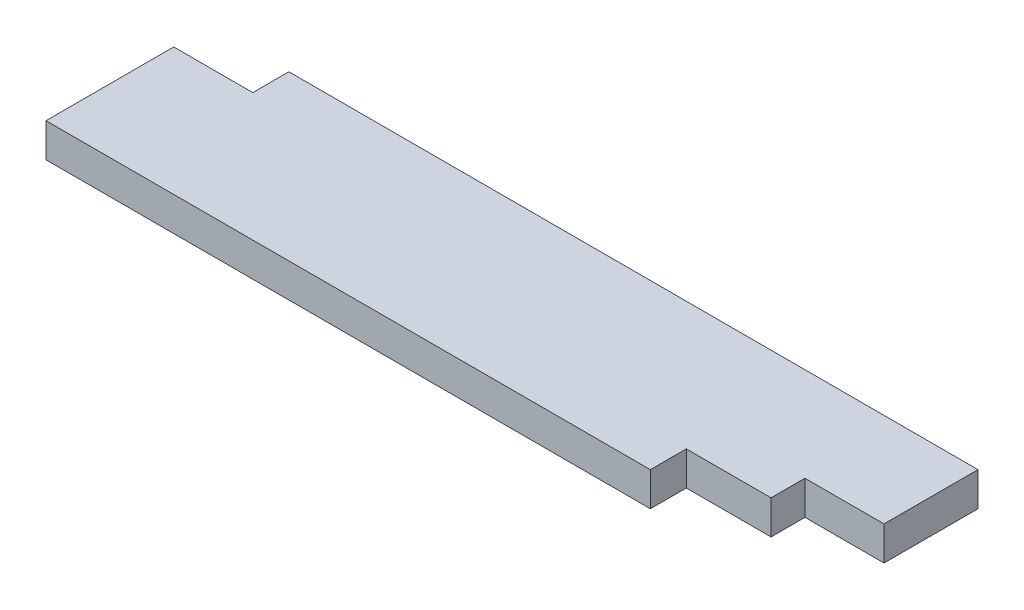
ISO-10303-21;
HEADER;
FILE_DESCRIPTION(('STEP AP214'),'2;1');
FILE_NAME('part.step','',(''),(''),'','','');
FILE_SCHEMA(('AUTOMOTIVE_DESIGN { 1 0 10303 214 1 1 1 1 }'));
ENDSEC;
DATA;
#1=APPLICATION_CONTEXT('core data for automotive mechanical design processes');
#2=APPLICATION_PROTOCOL_DEFINITION('international standard','automotive_design',2000,#1);
#3=PRODUCT_CONTEXT('',#1,'mechanical');
#4=PRODUCT('Part','Part','',(#3));
#5=PRODUCT_RELATED_PRODUCT_CATEGORY('part','',(#4));
#6=PRODUCT_DEFINITION_FORMATION('','',#4);
#7=PRODUCT_DEFINITION_CONTEXT('part definition',#1,'design');
#8=PRODUCT_DEFINITION('design','',#6,#7);
#9=PRODUCT_DEFINITION_SHAPE('','',#8);
#10=(LENGTH_UNIT() NAMED_UNIT(*) SI_UNIT(.MILLI.,.METRE.));
#11=(NAMED_UNIT(*) PLANE_ANGLE_UNIT() SI_UNIT($,.RADIAN.));
#12=(NAMED_UNIT(*) SI_UNIT($,.STERADIAN.) SOLID_ANGLE_UNIT());
#13=UNCERTAINTY_MEASURE_WITH_UNIT(LENGTH_MEASURE(1.E-05),#10,'distance_accuracy_value','');
#14=(GEOMETRIC_REPRESENTATION_CONTEXT(3) GLOBAL_UNCERTAINTY_ASSIGNED_CONTEXT((#13)) GLOBAL_UNIT_ASSIGNED_CONTEXT((#10,
#11,#12)) REPRESENTATION_CONTEXT('',''));
#15=CARTESIAN_POINT('',(0.,0.,0.));
#16=DIRECTION('',(0.,0.,1.));
#17=DIRECTION('',(1.,0.,0.));
#18=AXIS2_PLACEMENT_3D('',#15,#16,#17);
#19=CARTESIAN_POINT('',(0.,38.1,0.));
#20=DIRECTION('',(1.,0.,0.));
#21=DIRECTION('',(0.,0.,-1.));
#22=AXIS2_PLACEMENT_3D('',#19,#20,#21);
#23=PLANE('',#22);
#24=DIRECTION('',(0.,0.,1.));
#25=VECTOR('',#24,1.);
#26=CARTESIAN_POINT('',(0.,38.1,0.));
#27=LINE('',#26,#25);
#28=CARTESIAN_POINT('',(0.,38.1,-143.5735));
#29=VERTEX_POINT('',#28);
#30=CARTESIAN_POINT('',(0.,38.1,0.));
#31=VERTEX_POINT('',#30);
#32=EDGE_CURVE('E141',#29,#31,#27,.T.);
#33=ORIENTED_EDGE('',*,*,#32,.F.);
#34=DIRECTION('',(0.,1.,0.));
#35=VECTOR('',#34,1.);
#36=CARTESIAN_POINT('',(0.,0.,-143.5735));
#37=LINE('',#36,#35);
#38=CARTESIAN_POINT('',(0.,0.,-143.5735));
#39=VERTEX_POINT('',#38);
#40=EDGE_CURVE('E176',#39,#29,#37,.T.);
#41=ORIENTED_EDGE('',*,*,#40,.F.);
#42=DIRECTION('',(0.,0.,1.));
#43=VECTOR('',#42,1.);
#44=CARTESIAN_POINT('',(0.,0.,0.));
#45=LINE('',#44,#43);
#46=CARTESIAN_POINT('',(0.,0.,0.));
#47=VERTEX_POINT('',#46);
#48=EDGE_CURVE('E144',#39,#47,#45,.T.);
#49=ORIENTED_EDGE('',*,*,#48,.T.);
#50=DIRECTION('',(0.,-1.,0.));
#51=VECTOR('',#50,1.);
#52=CARTESIAN_POINT('',(0.,38.1,0.));
#53=LINE('',#52,#51);
#54=EDGE_CURVE('E11',#31,#47,#53,.T.);
#55=ORIENTED_EDGE('',*,*,#54,.F.);
#56=EDGE_LOOP('',(#33,#41,#49,#55));
#57=FACE_BOUND('',#56,.T.);
#58=ADVANCED_FACE('F39',(#57),#23,.F.);
#59=CARTESIAN_POINT('',(0.,38.1,0.));
#60=DIRECTION('',(0.,0.,-1.));
#61=DIRECTION('',(-1.,0.,0.));
#62=AXIS2_PLACEMENT_3D('',#59,#60,#61);
#63=PLANE('',#62);
#64=DIRECTION('',(1.,0.,0.));
#65=VECTOR('',#64,1.);
#66=CARTESIAN_POINT('',(0.,0.,0.));
#67=LINE('',#66,#65);
#68=CARTESIAN_POINT('',(679.45,0.,0.));
#69=VERTEX_POINT('',#68);
#70=EDGE_CURVE('E139',#47,#69,#67,.T.);
#71=ORIENTED_EDGE('',*,*,#70,.T.);
#72=DIRECTION('',(0.,1.,0.));
#73=VECTOR('',#72,1.);
#74=CARTESIAN_POINT('',(679.45,0.,0.));
#75=LINE('',#74,#73);
#76=CARTESIAN_POINT('',(679.45,38.1,0.));
#77=VERTEX_POINT('',#76);
#78=EDGE_CURVE('E157',#69,#77,#75,.T.);
#79=ORIENTED_EDGE('',*,*,#78,.T.);
#80=DIRECTION('',(1.,0.,0.));
#81=VECTOR('',#80,1.);
#82=CARTESIAN_POINT('',(0.,38.1,0.));
#83=LINE('',#82,#81);
#84=EDGE_CURVE('E154',#31,#77,#83,.T.);
#85=ORIENTED_EDGE('',*,*,#84,.F.);
#86=ORIENTED_EDGE('',*,*,#54,.T.);
#87=EDGE_LOOP('',(#71,#79,#85,#86));
#88=FACE_BOUND('',#87,.T.);
#89=ADVANCED_FACE('F198',(#88),#63,.F.);
#90=CARTESIAN_POINT('',(863.6,38.1,0.));
#91=DIRECTION('',(-1.,0.,0.));
#92=DIRECTION('',(0.,0.,1.));
#93=AXIS2_PLACEMENT_3D('',#90,#91,#92);
#94=PLANE('',#93);
#95=DIRECTION('',(0.,0.,-1.));
#96=VECTOR('',#95,1.);
#97=CARTESIAN_POINT('',(863.6,38.1,0.));
#98=LINE('',#97,#96);
#99=CARTESIAN_POINT('',(863.6,38.1,-78.486));
#100=VERTEX_POINT('',#99);
#101=CARTESIAN_POINT('',(863.6,38.1,-184.15));
#102=VERTEX_POINT('',#101);
#103=EDGE_CURVE('E131',#100,#102,#98,.T.);
#104=ORIENTED_EDGE('',*,*,#103,.F.);
#105=DIRECTION('',(0.,1.,0.));
#106=VECTOR('',#105,1.);
#107=CARTESIAN_POINT('',(863.6,0.,-78.486));
#108=LINE('',#107,#106);
#109=CARTESIAN_POINT('',(863.6,0.,-78.486));
#110=VERTEX_POINT('',#109);
#111=EDGE_CURVE('E118',#110,#100,#108,.T.);
#112=ORIENTED_EDGE('',*,*,#111,.F.);
#113=DIRECTION('',(0.,0.,-1.));
#114=VECTOR('',#113,1.);
#115=CARTESIAN_POINT('',(863.6,0.,0.));
#116=LINE('',#115,#114);
#117=CARTESIAN_POINT('',(863.6,0.,-184.15));
#118=VERTEX_POINT('',#117);
#119=EDGE_CURVE('E129',#110,#118,#116,.T.);
#120=ORIENTED_EDGE('',*,*,#119,.T.);
#121=DIRECTION('',(0.,-1.,0.));
#122=VECTOR('',#121,1.);
#123=CARTESIAN_POINT('',(863.6,38.1,-184.15));
#124=LINE('',#123,#122);
#125=EDGE_CURVE('E46',#102,#118,#124,.T.);
#126=ORIENTED_EDGE('',*,*,#125,.F.);
#127=EDGE_LOOP('',(#104,#112,#120,#126));
#128=FACE_BOUND('',#127,.T.);
#129=ADVANCED_FACE('F127',(#128),#94,.F.);
#130=CARTESIAN_POINT('',(0.,38.1,-184.15));
#131=DIRECTION('',(0.,0.,1.));
#132=DIRECTION('',(1.,0.,0.));
#133=AXIS2_PLACEMENT_3D('',#130,#131,#132);
#134=PLANE('',#133);
#135=DIRECTION('',(-1.,0.,0.));
#136=VECTOR('',#135,1.);
#137=CARTESIAN_POINT('',(0.,0.,-184.15));
#138=LINE('',#137,#136);
#139=CARTESIAN_POINT('',(88.9,0.,-184.15));
#140=VERTEX_POINT('',#139);
#141=EDGE_CURVE('E138',#118,#140,#138,.T.);
#142=ORIENTED_EDGE('',*,*,#141,.T.);
#143=DIRECTION('',(0.,1.,0.));
#144=VECTOR('',#143,1.);
#145=CARTESIAN_POINT('',(88.9,0.,-184.15));
#146=LINE('',#145,#144);
#147=CARTESIAN_POINT('',(88.9,38.1,-184.15));
#148=VERTEX_POINT('',#147);
#149=EDGE_CURVE('E180',#140,#148,#146,.T.);
#150=ORIENTED_EDGE('',*,*,#149,.T.);
#151=DIRECTION('',(-1.,0.,0.));
#152=VECTOR('',#151,1.);
#153=CARTESIAN_POINT('',(0.,38.1,-184.15));
#154=LINE('',#153,#152);
#155=EDGE_CURVE('E147',#102,#148,#154,.T.);
#156=ORIENTED_EDGE('',*,*,#155,.F.);
#157=ORIENTED_EDGE('',*,*,#125,.T.);
#158=EDGE_LOOP('',(#142,#150,#156,#157));
#159=FACE_BOUND('',#158,.T.);
#160=ADVANCED_FACE('F219',(#159),#134,.F.);
#161=CARTESIAN_POINT('',(0.,38.1,0.));
#162=DIRECTION('',(0.,-1.,0.));
#163=DIRECTION('',(0.,0.,-1.));
#164=AXIS2_PLACEMENT_3D('',#161,#162,#163);
#165=PLANE('',#164);
#166=ORIENTED_EDGE('',*,*,#84,.T.);
#167=DIRECTION('',(0.,0.,1.));
#168=VECTOR('',#167,1.);
#169=CARTESIAN_POINT('',(679.45,38.1,0.));
#170=LINE('',#169,#168);
#171=CARTESIAN_POINT('',(679.45,38.1,-40.386));
#172=VERTEX_POINT('',#171);
#173=EDGE_CURVE('E123',#172,#77,#170,.T.);
#174=ORIENTED_EDGE('',*,*,#173,.F.);
#175=DIRECTION('',(-1.,0.,0.));
#176=VECTOR('',#175,1.);
#177=CARTESIAN_POINT('',(774.7,38.1,-40.386));
#178=LINE('',#177,#176);
#179=CARTESIAN_POINT('',(774.7,38.1,-40.386));
#180=VERTEX_POINT('',#179);
#181=EDGE_CURVE('E212',#180,#172,#178,.T.);
#182=ORIENTED_EDGE('',*,*,#181,.F.);
#183=DIRECTION('',(0.,0.,1.));
#184=VECTOR('',#183,1.);
#185=CARTESIAN_POINT('',(774.7,38.1,-78.486));
#186=LINE('',#185,#184);
#187=CARTESIAN_POINT('',(774.7,38.1,-78.486));
#188=VERTEX_POINT('',#187);
#189=EDGE_CURVE('E210',#188,#180,#186,.T.);
#190=ORIENTED_EDGE('',*,*,#189,.F.);
#191=DIRECTION('',(-1.,0.,0.));
#192=VECTOR('',#191,1.);
#193=CARTESIAN_POINT('',(863.6,38.1,-78.486));
#194=LINE('',#193,#192);
#195=EDGE_CURVE('E189',#100,#188,#194,.T.);
#196=ORIENTED_EDGE('',*,*,#195,.F.);
#197=ORIENTED_EDGE('',*,*,#103,.T.);
#198=ORIENTED_EDGE('',*,*,#155,.T.);
#199=DIRECTION('',(0.,0.,-1.));
#200=VECTOR('',#199,1.);
#201=CARTESIAN_POINT('',(88.9,38.1,-184.15));
#202=LINE('',#201,#200);
#203=CARTESIAN_POINT('',(88.9,38.1,-143.5735));
#204=VERTEX_POINT('',#203);
#205=EDGE_CURVE('E183',#204,#148,#202,.T.);
#206=ORIENTED_EDGE('',*,*,#205,.F.);
#207=DIRECTION('',(1.,0.,0.));
#208=VECTOR('',#207,1.);
#209=CARTESIAN_POINT('',(0.,38.1,-143.5735));
#210=LINE('',#209,#208);
#211=EDGE_CURVE('E185',#29,#204,#210,.T.);
#212=ORIENTED_EDGE('',*,*,#211,.F.);
#213=ORIENTED_EDGE('',*,*,#32,.T.);
#214=EDGE_LOOP('',(#166,#174,#182,#190,#196,#197,#198,#206,#212,#213));
#215=FACE_BOUND('',#214,.T.);
#216=ADVANCED_FACE('F194',(#215),#165,.F.);
#217=CARTESIAN_POINT('',(0.,0.,0.));
#218=DIRECTION('',(0.,-1.,0.));
#219=DIRECTION('',(0.,0.,-1.));
#220=AXIS2_PLACEMENT_3D('',#217,#218,#219);
#221=PLANE('',#220);
#222=DIRECTION('',(0.,0.,1.));
#223=VECTOR('',#222,1.);
#224=CARTESIAN_POINT('',(679.45,0.,0.));
#225=LINE('',#224,#223);
#226=CARTESIAN_POINT('',(679.45,0.,-40.386));
#227=VERTEX_POINT('',#226);
#228=EDGE_CURVE('E132',#227,#69,#225,.T.);
#229=ORIENTED_EDGE('',*,*,#228,.T.);
#230=ORIENTED_EDGE('',*,*,#70,.F.);
#231=ORIENTED_EDGE('',*,*,#48,.F.);
#232=DIRECTION('',(1.,0.,0.));
#233=VECTOR('',#232,1.);
#234=CARTESIAN_POINT('',(0.,0.,-143.5735));
#235=LINE('',#234,#233);
#236=CARTESIAN_POINT('',(88.9,0.,-143.5735));
#237=VERTEX_POINT('',#236);
#238=EDGE_CURVE('E186',#39,#237,#235,.T.);
#239=ORIENTED_EDGE('',*,*,#238,.T.);
#240=DIRECTION('',(0.,0.,-1.));
#241=VECTOR('',#240,1.);
#242=CARTESIAN_POINT('',(88.9,0.,-184.15));
#243=LINE('',#242,#241);
#244=EDGE_CURVE('E61',#237,#140,#243,.T.);
#245=ORIENTED_EDGE('',*,*,#244,.T.);
#246=ORIENTED_EDGE('',*,*,#141,.F.);
#247=ORIENTED_EDGE('',*,*,#119,.F.);
#248=DIRECTION('',(-1.,0.,0.));
#249=VECTOR('',#248,1.);
#250=CARTESIAN_POINT('',(863.6,0.,-78.486));
#251=LINE('',#250,#249);
#252=CARTESIAN_POINT('',(774.7,0.,-78.486));
#253=VERTEX_POINT('',#252);
#254=EDGE_CURVE('E114',#110,#253,#251,.T.);
#255=ORIENTED_EDGE('',*,*,#254,.T.);
#256=DIRECTION('',(0.,0.,1.));
#257=VECTOR('',#256,1.);
#258=CARTESIAN_POINT('',(774.7,0.,-78.486));
#259=LINE('',#258,#257);
#260=CARTESIAN_POINT('',(774.7,0.,-40.386));
#261=VERTEX_POINT('',#260);
#262=EDGE_CURVE('E53',#253,#261,#259,.T.);
#263=ORIENTED_EDGE('',*,*,#262,.T.);
#264=DIRECTION('',(-1.,0.,0.));
#265=VECTOR('',#264,1.);
#266=CARTESIAN_POINT('',(774.7,0.,-40.386));
#267=LINE('',#266,#265);
#268=EDGE_CURVE('E203',#261,#227,#267,.T.);
#269=ORIENTED_EDGE('',*,*,#268,.T.);
#270=EDGE_LOOP('',(#229,#230,#231,#239,#245,#246,#247,#255,#263,#269));
#271=FACE_BOUND('',#270,.T.);
#272=ADVANCED_FACE('F136',(#271),#221,.T.);
#273=CARTESIAN_POINT('',(88.9,0.,-184.15));
#274=DIRECTION('',(1.,0.,0.));
#275=DIRECTION('',(0.,0.,-1.));
#276=AXIS2_PLACEMENT_3D('',#273,#274,#275);
#277=PLANE('',#276);
#278=ORIENTED_EDGE('',*,*,#205,.T.);
#279=ORIENTED_EDGE('',*,*,#149,.F.);
#280=ORIENTED_EDGE('',*,*,#244,.F.);
#281=DIRECTION('',(0.,1.,0.));
#282=VECTOR('',#281,1.);
#283=CARTESIAN_POINT('',(88.9,0.,-143.5735));
#284=LINE('',#283,#282);
#285=EDGE_CURVE('E178',#237,#204,#284,.T.);
#286=ORIENTED_EDGE('',*,*,#285,.T.);
#287=EDGE_LOOP('',(#278,#279,#280,#286));
#288=FACE_BOUND('',#287,.T.);
#289=ADVANCED_FACE('F220',(#288),#277,.F.);
#290=CARTESIAN_POINT('',(0.,0.,-143.5735));
#291=DIRECTION('',(0.,0.,1.));
#292=DIRECTION('',(1.,0.,0.));
#293=AXIS2_PLACEMENT_3D('',#290,#291,#292);
#294=PLANE('',#293);
#295=ORIENTED_EDGE('',*,*,#211,.T.);
#296=ORIENTED_EDGE('',*,*,#285,.F.);
#297=ORIENTED_EDGE('',*,*,#238,.F.);
#298=ORIENTED_EDGE('',*,*,#40,.T.);
#299=EDGE_LOOP('',(#295,#296,#297,#298));
#300=FACE_BOUND('',#299,.T.);
#301=ADVANCED_FACE('F221',(#300),#294,.F.);
#302=CARTESIAN_POINT('',(679.45,0.,0.));
#303=DIRECTION('',(-1.,0.,0.));
#304=DIRECTION('',(0.,0.,1.));
#305=AXIS2_PLACEMENT_3D('',#302,#303,#304);
#306=PLANE('',#305);
#307=ORIENTED_EDGE('',*,*,#173,.T.);
#308=ORIENTED_EDGE('',*,*,#78,.F.);
#309=ORIENTED_EDGE('',*,*,#228,.F.);
#310=DIRECTION('',(0.,1.,0.));
#311=VECTOR('',#310,1.);
#312=CARTESIAN_POINT('',(679.45,0.,-40.386));
#313=LINE('',#312,#311);
#314=EDGE_CURVE('E164',#227,#172,#313,.T.);
#315=ORIENTED_EDGE('',*,*,#314,.T.);
#316=EDGE_LOOP('',(#307,#308,#309,#315));
#317=FACE_BOUND('',#316,.T.);
#318=ADVANCED_FACE('F215',(#317),#306,.F.);
#319=CARTESIAN_POINT('',(774.7,0.,-40.386));
#320=DIRECTION('',(0.,0.,-1.));
#321=DIRECTION('',(-1.,0.,0.));
#322=AXIS2_PLACEMENT_3D('',#319,#320,#321);
#323=PLANE('',#322);
#324=ORIENTED_EDGE('',*,*,#181,.T.);
#325=ORIENTED_EDGE('',*,*,#314,.F.);
#326=ORIENTED_EDGE('',*,*,#268,.F.);
#327=DIRECTION('',(0.,1.,0.));
#328=VECTOR('',#327,1.);
#329=CARTESIAN_POINT('',(774.7,0.,-40.386));
#330=LINE('',#329,#328);
#331=EDGE_CURVE('E169',#261,#180,#330,.T.);
#332=ORIENTED_EDGE('',*,*,#331,.T.);
#333=EDGE_LOOP('',(#324,#325,#326,#332));
#334=FACE_BOUND('',#333,.T.);
#335=ADVANCED_FACE('F216',(#334),#323,.F.);
#336=CARTESIAN_POINT('',(774.7,0.,-78.486));
#337=DIRECTION('',(-1.,0.,0.));
#338=DIRECTION('',(0.,0.,1.));
#339=AXIS2_PLACEMENT_3D('',#336,#337,#338);
#340=PLANE('',#339);
#341=ORIENTED_EDGE('',*,*,#189,.T.);
#342=ORIENTED_EDGE('',*,*,#331,.F.);
#343=ORIENTED_EDGE('',*,*,#262,.F.);
#344=DIRECTION('',(0.,1.,0.));
#345=VECTOR('',#344,1.);
#346=CARTESIAN_POINT('',(774.7,0.,-78.486));
#347=LINE('',#346,#345);
#348=EDGE_CURVE('E120',#253,#188,#347,.T.);
#349=ORIENTED_EDGE('',*,*,#348,.T.);
#350=EDGE_LOOP('',(#341,#342,#343,#349));
#351=FACE_BOUND('',#350,.T.);
#352=ADVANCED_FACE('F218',(#351),#340,.F.);
#353=CARTESIAN_POINT('',(863.6,0.,-78.486));
#354=DIRECTION('',(0.,0.,-1.));
#355=DIRECTION('',(-1.,0.,0.));
#356=AXIS2_PLACEMENT_3D('',#353,#354,#355);
#357=PLANE('',#356);
#358=ORIENTED_EDGE('',*,*,#195,.T.);
#359=ORIENTED_EDGE('',*,*,#348,.F.);
#360=ORIENTED_EDGE('',*,*,#254,.F.);
#361=ORIENTED_EDGE('',*,*,#111,.T.);
#362=EDGE_LOOP('',(#358,#359,#360,#361));
#363=FACE_BOUND('',#362,.T.);
#364=ADVANCED_FACE('F117',(#363),#357,.F.);
#365=CLOSED_SHELL('',(#58,#89,#129,#160,#216,#272,#289,#301,#318,#335,#352,#364));
#366=MANIFOLD_SOLID_BREP('B2',#365);
#367=ADVANCED_BREP_SHAPE_REPRESENTATION('',(#18,#366),#14);
#368=SHAPE_DEFINITION_REPRESENTATION(#9,#367);
ENDSEC;
END-ISO-10303-21;
